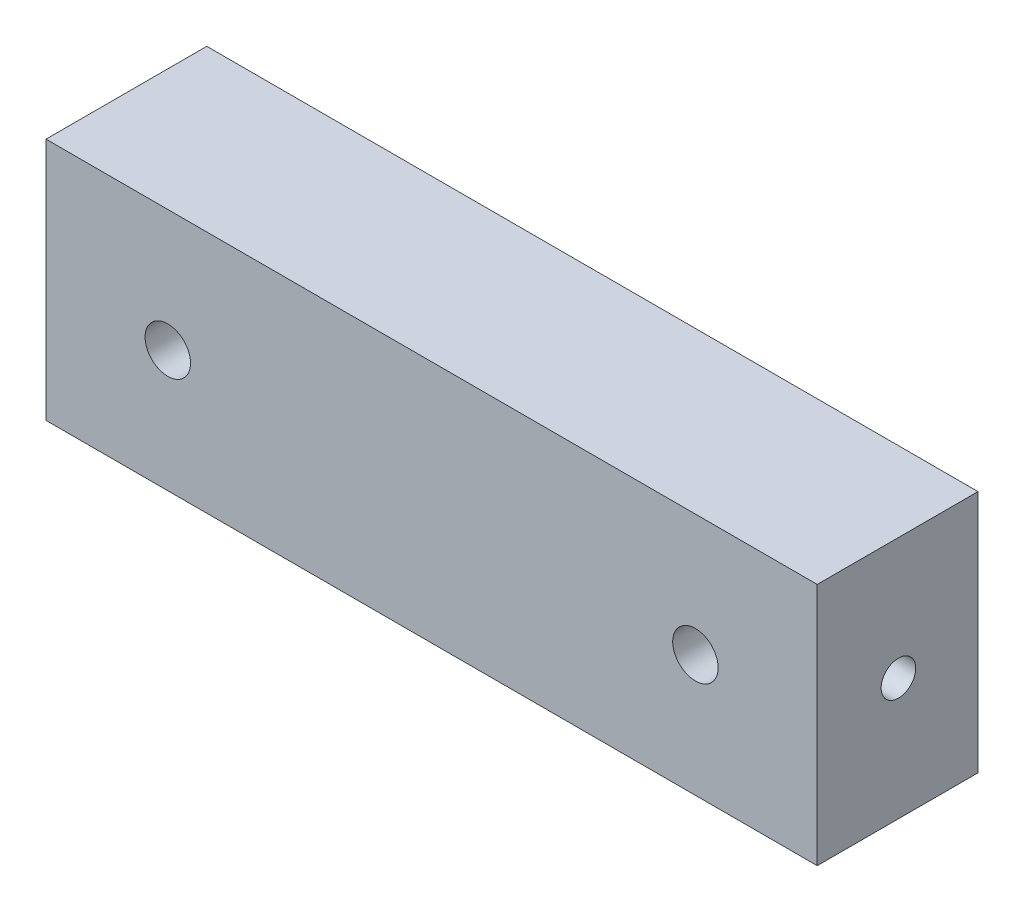
ISO-10303-21;
HEADER;
FILE_DESCRIPTION(('STEP AP214'),'2;1');
FILE_NAME('part.step','',(''),(''),'','','');
FILE_SCHEMA(('AUTOMOTIVE_DESIGN { 1 0 10303 214 1 1 1 1 }'));
ENDSEC;
DATA;
#1=APPLICATION_CONTEXT('core data for automotive mechanical design processes');
#2=APPLICATION_PROTOCOL_DEFINITION('international standard','automotive_design',2000,#1);
#3=PRODUCT_CONTEXT('',#1,'mechanical');
#4=PRODUCT('Part','Part','',(#3));
#5=PRODUCT_RELATED_PRODUCT_CATEGORY('part','',(#4));
#6=PRODUCT_DEFINITION_FORMATION('','',#4);
#7=PRODUCT_DEFINITION_CONTEXT('part definition',#1,'design');
#8=PRODUCT_DEFINITION('design','',#6,#7);
#9=PRODUCT_DEFINITION_SHAPE('','',#8);
#10=(LENGTH_UNIT() NAMED_UNIT(*) SI_UNIT(.MILLI.,.METRE.));
#11=(NAMED_UNIT(*) PLANE_ANGLE_UNIT() SI_UNIT($,.RADIAN.));
#12=(NAMED_UNIT(*) SI_UNIT($,.STERADIAN.) SOLID_ANGLE_UNIT());
#13=UNCERTAINTY_MEASURE_WITH_UNIT(LENGTH_MEASURE(1.E-05),#10,'distance_accuracy_value','');
#14=(GEOMETRIC_REPRESENTATION_CONTEXT(3) GLOBAL_UNCERTAINTY_ASSIGNED_CONTEXT((#13)) GLOBAL_UNIT_ASSIGNED_CONTEXT((#10,
#11,#12)) REPRESENTATION_CONTEXT('',''));
#15=CARTESIAN_POINT('',(0.,0.,0.));
#16=DIRECTION('',(0.,0.,1.));
#17=DIRECTION('',(1.,0.,0.));
#18=AXIS2_PLACEMENT_3D('',#15,#16,#17);
#19=CARTESIAN_POINT('',(0.,0.,12.573));
#20=DIRECTION('',(1.,0.,0.));
#21=DIRECTION('',(0.,0.,-1.));
#22=AXIS2_PLACEMENT_3D('',#19,#20,#21);
#23=PLANE('',#22);
#24=CARTESIAN_POINT('',(0.,9.525,6.223));
#25=DIRECTION('',(-1.,0.,0.));
#26=DIRECTION('',(0.,0.,1.));
#27=AXIS2_PLACEMENT_3D('',#24,#25,#26);
#28=CIRCLE('',#27,1.35255);
#29=CARTESIAN_POINT('',(0.,9.525,7.57555));
#30=VERTEX_POINT('',#29);
#31=EDGE_CURVE('E123',#30,#30,#28,.T.);
#32=ORIENTED_EDGE('',*,*,#31,.F.);
#33=EDGE_LOOP('',(#32));
#34=FACE_BOUND('',#33,.T.);
#35=DIRECTION('',(0.,-1.,0.));
#36=VECTOR('',#35,1.);
#37=CARTESIAN_POINT('',(0.,0.,0.));
#38=LINE('',#37,#36);
#39=CARTESIAN_POINT('',(0.,19.05,0.));
#40=VERTEX_POINT('',#39);
#41=CARTESIAN_POINT('',(0.,0.,0.));
#42=VERTEX_POINT('',#41);
#43=EDGE_CURVE('E108',#40,#42,#38,.T.);
#44=ORIENTED_EDGE('',*,*,#43,.T.);
#45=DIRECTION('',(0.,0.,-1.));
#46=VECTOR('',#45,1.);
#47=CARTESIAN_POINT('',(0.,0.,12.573));
#48=LINE('',#47,#46);
#49=CARTESIAN_POINT('',(0.,0.,12.573));
#50=VERTEX_POINT('',#49);
#51=EDGE_CURVE('E11',#50,#42,#48,.T.);
#52=ORIENTED_EDGE('',*,*,#51,.F.);
#53=DIRECTION('',(0.,-1.,0.));
#54=VECTOR('',#53,1.);
#55=CARTESIAN_POINT('',(0.,0.,12.573));
#56=LINE('',#55,#54);
#57=CARTESIAN_POINT('',(0.,19.05,12.573));
#58=VERTEX_POINT('',#57);
#59=EDGE_CURVE('E95',#58,#50,#56,.T.);
#60=ORIENTED_EDGE('',*,*,#59,.F.);
#61=DIRECTION('',(0.,0.,-1.));
#62=VECTOR('',#61,1.);
#63=CARTESIAN_POINT('',(0.,19.05,12.573));
#64=LINE('',#63,#62);
#65=EDGE_CURVE('E104',#58,#40,#64,.T.);
#66=ORIENTED_EDGE('',*,*,#65,.T.);
#67=EDGE_LOOP('',(#44,#52,#60,#66));
#68=FACE_BOUND('',#67,.T.);
#69=ADVANCED_FACE('F38',(#34,#68),#23,.F.);
#70=CARTESIAN_POINT('',(0.,0.,12.573));
#71=DIRECTION('',(0.,1.,0.));
#72=DIRECTION('',(0.,0.,1.));
#73=AXIS2_PLACEMENT_3D('',#70,#71,#72);
#74=PLANE('',#73);
#75=DIRECTION('',(1.,0.,0.));
#76=VECTOR('',#75,1.);
#77=CARTESIAN_POINT('',(0.,0.,0.));
#78=LINE('',#77,#76);
#79=CARTESIAN_POINT('',(60.3123,0.,0.));
#80=VERTEX_POINT('',#79);
#81=EDGE_CURVE('E99',#42,#80,#78,.T.);
#82=ORIENTED_EDGE('',*,*,#81,.T.);
#83=DIRECTION('',(0.,0.,-1.));
#84=VECTOR('',#83,1.);
#85=CARTESIAN_POINT('',(60.3123,0.,12.573));
#86=LINE('',#85,#84);
#87=CARTESIAN_POINT('',(60.3123,0.,12.573));
#88=VERTEX_POINT('',#87);
#89=EDGE_CURVE('E51',#88,#80,#86,.T.);
#90=ORIENTED_EDGE('',*,*,#89,.F.);
#91=DIRECTION('',(1.,0.,0.));
#92=VECTOR('',#91,1.);
#93=CARTESIAN_POINT('',(0.,0.,12.573));
#94=LINE('',#93,#92);
#95=EDGE_CURVE('E90',#50,#88,#94,.T.);
#96=ORIENTED_EDGE('',*,*,#95,.F.);
#97=ORIENTED_EDGE('',*,*,#51,.T.);
#98=EDGE_LOOP('',(#82,#90,#96,#97));
#99=FACE_BOUND('',#98,.T.);
#100=ADVANCED_FACE('F98',(#99),#74,.F.);
#101=CARTESIAN_POINT('',(60.3123,0.,12.573));
#102=DIRECTION('',(-1.,0.,0.));
#103=DIRECTION('',(0.,0.,1.));
#104=AXIS2_PLACEMENT_3D('',#101,#102,#103);
#105=PLANE('',#104);
#106=CARTESIAN_POINT('',(60.3123,9.525,6.223));
#107=DIRECTION('',(1.,0.,0.));
#108=DIRECTION('',(0.,0.,-1.));
#109=AXIS2_PLACEMENT_3D('',#106,#107,#108);
#110=CIRCLE('',#109,1.35254999999999);
#111=CARTESIAN_POINT('',(60.3123,9.525,4.87045000000001));
#112=VERTEX_POINT('',#111);
#113=EDGE_CURVE('E173',#112,#112,#110,.T.);
#114=ORIENTED_EDGE('',*,*,#113,.F.);
#115=EDGE_LOOP('',(#114));
#116=FACE_BOUND('',#115,.T.);
#117=DIRECTION('',(0.,1.,0.));
#118=VECTOR('',#117,1.);
#119=CARTESIAN_POINT('',(60.3123,0.,0.));
#120=LINE('',#119,#118);
#121=CARTESIAN_POINT('',(60.3123,19.05,0.));
#122=VERTEX_POINT('',#121);
#123=EDGE_CURVE('E77',#80,#122,#120,.T.);
#124=ORIENTED_EDGE('',*,*,#123,.T.);
#125=DIRECTION('',(0.,0.,-1.));
#126=VECTOR('',#125,1.);
#127=CARTESIAN_POINT('',(60.3123,19.05,12.573));
#128=LINE('',#127,#126);
#129=CARTESIAN_POINT('',(60.3123,19.05,12.573));
#130=VERTEX_POINT('',#129);
#131=EDGE_CURVE('E100',#130,#122,#128,.T.);
#132=ORIENTED_EDGE('',*,*,#131,.F.);
#133=DIRECTION('',(0.,1.,0.));
#134=VECTOR('',#133,1.);
#135=CARTESIAN_POINT('',(60.3123,0.,12.573));
#136=LINE('',#135,#134);
#137=EDGE_CURVE('E93',#88,#130,#136,.T.);
#138=ORIENTED_EDGE('',*,*,#137,.F.);
#139=ORIENTED_EDGE('',*,*,#89,.T.);
#140=EDGE_LOOP('',(#124,#132,#138,#139));
#141=FACE_BOUND('',#140,.T.);
#142=ADVANCED_FACE('F102',(#116,#141),#105,.F.);
#143=CARTESIAN_POINT('',(0.,19.05,12.573));
#144=DIRECTION('',(0.,-1.,0.));
#145=DIRECTION('',(0.,0.,-1.));
#146=AXIS2_PLACEMENT_3D('',#143,#144,#145);
#147=PLANE('',#146);
#148=DIRECTION('',(-1.,0.,0.));
#149=VECTOR('',#148,1.);
#150=CARTESIAN_POINT('',(0.,19.05,0.));
#151=LINE('',#150,#149);
#152=EDGE_CURVE('E83',#122,#40,#151,.T.);
#153=ORIENTED_EDGE('',*,*,#152,.T.);
#154=ORIENTED_EDGE('',*,*,#65,.F.);
#155=DIRECTION('',(-1.,0.,0.));
#156=VECTOR('',#155,1.);
#157=CARTESIAN_POINT('',(0.,19.05,12.573));
#158=LINE('',#157,#156);
#159=EDGE_CURVE('E60',#130,#58,#158,.T.);
#160=ORIENTED_EDGE('',*,*,#159,.F.);
#161=ORIENTED_EDGE('',*,*,#131,.T.);
#162=EDGE_LOOP('',(#153,#154,#160,#161));
#163=FACE_BOUND('',#162,.T.);
#164=ADVANCED_FACE('F160',(#163),#147,.F.);
#165=CARTESIAN_POINT('',(0.,19.05,12.573));
#166=DIRECTION('',(0.,0.,-1.));
#167=DIRECTION('',(-1.,0.,0.));
#168=AXIS2_PLACEMENT_3D('',#165,#166,#167);
#169=PLANE('',#168);
#170=CARTESIAN_POINT('',(50.7873,9.525,12.573));
#171=DIRECTION('',(0.,0.,1.));
#172=DIRECTION('',(1.,0.,0.));
#173=AXIS2_PLACEMENT_3D('',#170,#171,#172);
#174=CIRCLE('',#173,1.778);
#175=CARTESIAN_POINT('',(52.5653,9.525,12.573));
#176=VERTEX_POINT('',#175);
#177=EDGE_CURVE('E122',#176,#176,#174,.T.);
#178=ORIENTED_EDGE('',*,*,#177,.F.);
#179=EDGE_LOOP('',(#178));
#180=FACE_BOUND('',#179,.T.);
#181=CARTESIAN_POINT('',(9.525,9.525,12.573));
#182=DIRECTION('',(0.,0.,1.));
#183=DIRECTION('',(1.,0.,0.));
#184=AXIS2_PLACEMENT_3D('',#181,#182,#183);
#185=CIRCLE('',#184,1.778);
#186=CARTESIAN_POINT('',(11.303,9.525,12.573));
#187=VERTEX_POINT('',#186);
#188=EDGE_CURVE('E180',#187,#187,#185,.T.);
#189=ORIENTED_EDGE('',*,*,#188,.F.);
#190=EDGE_LOOP('',(#189));
#191=FACE_BOUND('',#190,.T.);
#192=ORIENTED_EDGE('',*,*,#59,.T.);
#193=ORIENTED_EDGE('',*,*,#95,.T.);
#194=ORIENTED_EDGE('',*,*,#137,.T.);
#195=ORIENTED_EDGE('',*,*,#159,.T.);
#196=EDGE_LOOP('',(#192,#193,#194,#195));
#197=FACE_BOUND('',#196,.T.);
#198=ADVANCED_FACE('F91',(#180,#191,#197),#169,.F.);
#199=CARTESIAN_POINT('',(0.,19.05,0.));
#200=DIRECTION('',(0.,0.,-1.));
#201=DIRECTION('',(-1.,0.,0.));
#202=AXIS2_PLACEMENT_3D('',#199,#200,#201);
#203=PLANE('',#202);
#204=CARTESIAN_POINT('',(50.7873,9.525,0.));
#205=DIRECTION('',(0.,0.,1.));
#206=DIRECTION('',(1.,0.,0.));
#207=AXIS2_PLACEMENT_3D('',#204,#205,#206);
#208=CIRCLE('',#207,1.778);
#209=CARTESIAN_POINT('',(52.5653,9.525,0.));
#210=VERTEX_POINT('',#209);
#211=EDGE_CURVE('E178',#210,#210,#208,.T.);
#212=ORIENTED_EDGE('',*,*,#211,.T.);
#213=EDGE_LOOP('',(#212));
#214=FACE_BOUND('',#213,.T.);
#215=CARTESIAN_POINT('',(9.525,9.525,0.));
#216=DIRECTION('',(0.,0.,1.));
#217=DIRECTION('',(1.,0.,0.));
#218=AXIS2_PLACEMENT_3D('',#215,#216,#217);
#219=CIRCLE('',#218,1.778);
#220=CARTESIAN_POINT('',(11.303,9.525,0.));
#221=VERTEX_POINT('',#220);
#222=EDGE_CURVE('E111',#221,#221,#219,.T.);
#223=ORIENTED_EDGE('',*,*,#222,.T.);
#224=EDGE_LOOP('',(#223));
#225=FACE_BOUND('',#224,.T.);
#226=ORIENTED_EDGE('',*,*,#43,.F.);
#227=ORIENTED_EDGE('',*,*,#152,.F.);
#228=ORIENTED_EDGE('',*,*,#123,.F.);
#229=ORIENTED_EDGE('',*,*,#81,.F.);
#230=EDGE_LOOP('',(#226,#227,#228,#229));
#231=FACE_BOUND('',#230,.T.);
#232=ADVANCED_FACE('F140',(#214,#225,#231),#203,.T.);
#233=CARTESIAN_POINT('',(9.525,9.525,0.));
#234=DIRECTION('',(0.,0.,1.));
#235=DIRECTION('',(1.,0.,0.));
#236=AXIS2_PLACEMENT_3D('',#233,#234,#235);
#237=CYLINDRICAL_SURFACE('',#236,1.778);
#238=CARTESIAN_POINT('',(7.747,9.525,7.57555));
#239=CARTESIAN_POINT('',(7.747005120892,9.59081623274751,7.5755446833929));
#240=CARTESIAN_POINT('',(7.75069180704347,9.65671589831385,7.57070816369258));
#241=CARTESIAN_POINT('',(7.76510620060708,9.78641557434088,7.55167255000671));
#242=CARTESIAN_POINT('',(7.77584802079086,9.85021110659428,7.53745468974687));
#243=CARTESIAN_POINT('',(7.80334387417839,9.97349892797805,7.50063692123175));
#244=CARTESIAN_POINT('',(7.82006206623453,10.0330143827258,7.47808695525382));
#245=CARTESIAN_POINT('',(7.85826484963585,10.1470106667715,7.42567816693626));
#246=CARTESIAN_POINT('',(7.87974870729648,10.201492269215,7.39582046956467));
#247=CARTESIAN_POINT('',(7.92831130362231,10.3096678425812,7.32671424106221));
#248=CARTESIAN_POINT('',(7.95572493229286,10.3628147456522,7.28684968849072));
#249=CARTESIAN_POINT('',(8.01291159967027,10.4621036174162,7.20052995103554));
#250=CARTESIAN_POINT('',(8.04268811527327,10.5082349608205,7.15406497142815));
#251=CARTESIAN_POINT('',(8.10900496126607,10.6021213130315,7.04484339777918));
#252=CARTESIAN_POINT('',(8.14565877823805,10.6482022124998,6.98071120837047));
#253=CARTESIAN_POINT('',(8.21572800092272,10.7291342448959,6.84408212220251));
#254=CARTESIAN_POINT('',(8.24914745104023,10.7639995325928,6.77159592695998));
#255=CARTESIAN_POINT('',(8.29695217354343,10.8110370464738,6.6452706947784));
#256=CARTESIAN_POINT('',(8.31390560203957,10.8268808765087,6.5937841477997));
#257=CARTESIAN_POINT('',(8.34202034458572,10.8524812927084,6.48784203144835));
#258=CARTESIAN_POINT('',(8.35319514399215,10.8622520622036,6.43339370535339));
#259=CARTESIAN_POINT('',(8.36799685777329,10.8750866771625,6.32208429271187));
#260=CARTESIAN_POINT('',(8.37154835864876,10.8780835268726,6.26520472618543));
#261=CARTESIAN_POINT('',(8.37011435505913,10.8768591661166,6.15162272078091));
#262=CARTESIAN_POINT('',(8.36512701100789,10.8726364002761,6.09492032270818));
#263=CARTESIAN_POINT('',(8.34868918991928,10.8582935993621,5.99021900090233));
#264=CARTESIAN_POINT('',(8.33806182563304,10.8489201360001,5.94197716646368));
#265=CARTESIAN_POINT('',(8.31234332562322,10.825404649053,5.8479089422327));
#266=CARTESIAN_POINT('',(8.29724761087562,10.8112577316923,5.80208508734661));
#267=CARTESIAN_POINT('',(8.25331963684761,10.7682054281516,5.68458420578281));
#268=CARTESIAN_POINT('',(8.22189336946962,10.7356577319655,5.61521356883487));
#269=CARTESIAN_POINT('',(8.15574124734123,10.6603174029444,5.48395060278225));
#270=CARTESIAN_POINT('',(8.12100728555834,10.6174991863835,5.42207753871658));
#271=CARTESIAN_POINT('',(8.05076058939236,10.5207821722936,5.30443085375405));
#272=CARTESIAN_POINT('',(8.01525468557508,10.4665966385413,5.24888774327815));
#273=CARTESIAN_POINT('',(7.94766167597324,10.3483539700435,5.14710849538209));
#274=CARTESIAN_POINT('',(7.91556832847098,10.2843154010676,5.10085522367229));
#275=CARTESIAN_POINT('',(7.86322171304458,10.1601460899398,5.02711172570514));
#276=CARTESIAN_POINT('',(7.8418778217344,10.1016068192729,4.99772503450837));
#277=CARTESIAN_POINT('',(7.80484318512855,9.97932872981405,4.94732756227599));
#278=CARTESIAN_POINT('',(7.78914908485993,9.91559302445471,4.92631180959688));
#279=CARTESIAN_POINT('',(7.76467961885104,9.78396250760968,4.89373241102885));
#280=CARTESIAN_POINT('',(7.755950831483,9.71604291483113,4.88223238001389));
#281=CARTESIAN_POINT('',(7.74648130533183,9.57869830881292,4.86976172685191));
#282=CARTESIAN_POINT('',(7.7457363096101,9.50927411761124,4.86878549343956));
#283=CARTESIAN_POINT('',(7.75193378618309,9.37904017289857,4.87694075169575));
#284=CARTESIAN_POINT('',(7.75804640859121,9.31811693992983,4.88498109119072));
#285=CARTESIAN_POINT('',(7.77614343520465,9.19876492480107,4.90897232845607));
#286=CARTESIAN_POINT('',(7.78812895137045,9.14033661730306,4.92492472428435));
#287=CARTESIAN_POINT('',(7.8174631416235,9.02581239210051,4.96444156098346));
#288=CARTESIAN_POINT('',(7.83494074597089,8.96981390233613,4.98818968347289));
#289=CARTESIAN_POINT('',(7.87399333905008,8.86264162072927,5.04220450053682));
#290=CARTESIAN_POINT('',(7.89556895002123,8.81146856334621,5.07247218513217));
#291=CARTESIAN_POINT('',(7.94540316390411,8.70642406420291,5.14410936557713));
#292=CARTESIAN_POINT('',(7.97417748397433,8.65348629076092,5.186485466556));
#293=CARTESIAN_POINT('',(8.0337895553744,8.55500033792529,5.27800133817605));
#294=CARTESIAN_POINT('',(8.06463134908374,8.50946726895183,5.32715457028009));
#295=CARTESIAN_POINT('',(8.13246661639644,8.41775406874433,5.44207462859235));
#296=CARTESIAN_POINT('',(8.16945775757638,8.37326299709856,5.50919853784452));
#297=CARTESIAN_POINT('',(8.23893597028817,8.29617984848311,5.65207824368));
#298=CARTESIAN_POINT('',(8.2714332405626,8.2635605445613,5.72781375948899));
#299=CARTESIAN_POINT('',(8.31512117799614,8.22191953572198,5.85688171085918));
#300=CARTESIAN_POINT('',(8.3297044855007,8.20864515291234,5.90767706166241));
#301=CARTESIAN_POINT('',(8.35283602039945,8.18800384716894,6.01173530998742));
#302=CARTESIAN_POINT('',(8.36139868779459,8.18062278379309,6.06499197471875));
#303=CARTESIAN_POINT('',(8.37110439257758,8.17227801069038,6.17310914680572));
#304=CARTESIAN_POINT('',(8.37219332350749,8.17136109717897,6.22797846771401));
#305=CARTESIAN_POINT('',(8.36658701652079,8.17615862059877,6.33704399621304));
#306=CARTESIAN_POINT('',(8.35988424721523,8.18187947352661,6.3912395012873));
#307=CARTESIAN_POINT('',(8.338341404683,8.20085679968915,6.50569713837867));
#308=CARTESIAN_POINT('',(8.32238337384578,8.21516069686164,6.56556561105243));
#309=CARTESIAN_POINT('',(8.28452072646679,8.25096267970898,6.68115137620063));
#310=CARTESIAN_POINT('',(8.26260068416956,8.27247946162342,6.73685741570176));
#311=CARTESIAN_POINT('',(8.20614841220181,8.33161511601366,6.86484725921215));
#312=CARTESIAN_POINT('',(8.17004511646936,8.37223886551396,6.93504241226056));
#313=CARTESIAN_POINT('',(8.09644023946366,8.46480332493383,7.06671584239478));
#314=CARTESIAN_POINT('',(8.05893708186944,8.51675713254151,7.12818389392398));
#315=CARTESIAN_POINT('',(7.98571443561246,8.63244888984702,7.24253677235028));
#316=CARTESIAN_POINT('',(7.95003060458601,8.69635353993682,7.29527735767779));
#317=CARTESIAN_POINT('',(7.88464941998115,8.83481348688169,7.38918474362665));
#318=CARTESIAN_POINT('',(7.85493842879659,8.90934384114051,7.43037799681311));
#319=CARTESIAN_POINT('',(7.8118819338652,9.04532145466365,7.48915812347842));
#320=CARTESIAN_POINT('',(7.79628329950264,9.10460392776768,7.51012493621694));
#321=CARTESIAN_POINT('',(7.77111338349718,9.22664002123375,7.54373929680195));
#322=CARTESIAN_POINT('',(7.7615271932244,9.28938463263237,7.55640742580359));
#323=CARTESIAN_POINT('',(7.7525759520528,9.38140466305832,7.56821326272973));
#324=CARTESIAN_POINT('',(7.75049009113595,9.41000665892609,7.57095934530937));
#325=CARTESIAN_POINT('',(7.74770083716958,9.46740041401884,7.57462908475432));
#326=CARTESIAN_POINT('',(7.74699775858402,9.49619221491479,7.57555232708054));
#327=CARTESIAN_POINT('',(7.747,9.525,7.57555));
#328=B_SPLINE_CURVE_WITH_KNOTS('',3,(#238,#239,#240,#241,#242,#243,#244,#245,#246,#247,#248,
#249,#250,#251,#252,#253,#254,#255,#256,#257,#258,#259,#260,#261,#262,#263,#264,#265,#266,#267,
#268,#269,#270,#271,#272,#273,#274,#275,#276,#277,#278,#279,#280,#281,#282,#283,#284,#285,#286,
#287,#288,#289,#290,#291,#292,#293,#294,#295,#296,#297,#298,#299,#300,#301,#302,#303,#304,#305,
#306,#307,#308,#309,#310,#311,#312,#313,#314,#315,#316,#317,#318,#319,#320,#321,#322,#323,#324,
#325,#326,#327),.UNSPECIFIED.,.T.,.F.,(4,2,2,2,2,2,2,2,2,2,2,2,2,2,2,2,2,2,2,2,2,2,2,2,2,2,2,2,
2,2,2,2,2,2,2,2,2,2,2,2,2,2,2,2,4),(0.,0.197324853760894,0.39504563437113,0.591600018001237,
0.78812416263308,1.00297190457147,1.21814186734088,1.4782627572921,1.73805405937842,
1.90692296780565,2.07539599465778,2.24552810398773,2.41569687074086,2.56598590406469,
2.71642948519279,2.96353615933085,3.21126488478738,3.46621839153259,3.72069725115884,
3.92654991199555,4.13228013046612,4.33937483963228,4.54635912089801,4.73076101359689,
4.91519783403363,5.10433636955439,5.2935036467709,5.51369238067729,5.73432495268798,
5.99904821875222,6.26316047928862,6.42605919862902,6.5885658739052,6.75224779423849,
6.91608805972398,7.10580396949174,7.29601548671726,7.56097992269594,7.82625230004865,
8.09554602768511,8.36421772123898,8.55780337349536,8.75090708745218,8.83725660112776,
8.92362574961613),.UNSPECIFIED.);
#329=CARTESIAN_POINT('',(7.747,9.525,7.57555));
#330=VERTEX_POINT('',#329);
#331=EDGE_CURVE('E116',#330,#330,#328,.T.);
#332=ORIENTED_EDGE('',*,*,#331,.T.);
#333=EDGE_LOOP('',(#332));
#334=FACE_BOUND('',#333,.T.);
#335=ORIENTED_EDGE('',*,*,#222,.F.);
#336=EDGE_LOOP('',(#335));
#337=FACE_BOUND('',#336,.T.);
#338=ORIENTED_EDGE('',*,*,#188,.T.);
#339=EDGE_LOOP('',(#338));
#340=FACE_BOUND('',#339,.T.);
#341=ADVANCED_FACE('F124',(#334,#337,#340),#237,.F.);
#342=CARTESIAN_POINT('',(50.7873,9.525,0.));
#343=DIRECTION('',(0.,0.,1.));
#344=DIRECTION('',(1.,0.,0.));
#345=AXIS2_PLACEMENT_3D('',#342,#343,#344);
#346=CYLINDRICAL_SURFACE('',#345,1.778);
#347=CARTESIAN_POINT('',(52.5653,9.525,4.87045000000001));
#348=CARTESIAN_POINT('',(52.565294879108,9.59081623274751,4.87045531660711));
#349=CARTESIAN_POINT('',(52.5616081929565,9.65671589831385,4.87529183630742));
#350=CARTESIAN_POINT('',(52.5471937993929,9.78641557434088,4.8943274499933));
#351=CARTESIAN_POINT('',(52.5364519792091,9.85021110659428,4.90854531025314));
#352=CARTESIAN_POINT('',(52.5089561258216,9.97349892797804,4.94536307876826));
#353=CARTESIAN_POINT('',(52.4922379337655,10.0330143827258,4.96791304474618));
#354=CARTESIAN_POINT('',(52.4540351503641,10.1470106667715,5.02032183306375));
#355=CARTESIAN_POINT('',(52.4325512927035,10.201492269215,5.05017953043534));
#356=CARTESIAN_POINT('',(52.3839886963777,10.3096678425812,5.1192857589378));
#357=CARTESIAN_POINT('',(52.3565750677071,10.3628147456522,5.15915031150929));
#358=CARTESIAN_POINT('',(52.2993884003297,10.4621036174162,5.24547004896446));
#359=CARTESIAN_POINT('',(52.2696118847267,10.5082349608205,5.29193502857186));
#360=CARTESIAN_POINT('',(52.2032950387339,10.6021213130315,5.40115660222083));
#361=CARTESIAN_POINT('',(52.1666412217619,10.6482022124998,5.46528879162954));
#362=CARTESIAN_POINT('',(52.0965719990773,10.7291342448959,5.6019178777975));
#363=CARTESIAN_POINT('',(52.0631525489598,10.7639995325928,5.67440407304003));
#364=CARTESIAN_POINT('',(52.0153478264566,10.8110370464738,5.8007293052216));
#365=CARTESIAN_POINT('',(51.9983943979604,10.8268808765087,5.85221585220031));
#366=CARTESIAN_POINT('',(51.9702796554143,10.8524812927084,5.95815796855166));
#367=CARTESIAN_POINT('',(51.9591048560079,10.8622520622036,6.01260629464662));
#368=CARTESIAN_POINT('',(51.9443031422267,10.8750866771625,6.12391570728814));
#369=CARTESIAN_POINT('',(51.9407516413512,10.8780835268726,6.18079527381458));
#370=CARTESIAN_POINT('',(51.9421856449409,10.8768591661166,6.29437727921909));
#371=CARTESIAN_POINT('',(51.9471729889921,10.8726364002761,6.35107967729182));
#372=CARTESIAN_POINT('',(51.9636108100807,10.8582935993621,6.45578099909767));
#373=CARTESIAN_POINT('',(51.974238174367,10.8489201360001,6.50402283353632));
#374=CARTESIAN_POINT('',(51.9999566743768,10.825404649053,6.5980910577673));
#375=CARTESIAN_POINT('',(52.0150523891244,10.8112577316922,6.64391491265339));
#376=CARTESIAN_POINT('',(52.0589803631524,10.7682054281516,6.76141579421719));
#377=CARTESIAN_POINT('',(52.0904066305304,10.7356577319654,6.83078643116513));
#378=CARTESIAN_POINT('',(52.1565587526588,10.6603174029444,6.96204939721775));
#379=CARTESIAN_POINT('',(52.1912927144417,10.6174991863835,7.02392246128342));
#380=CARTESIAN_POINT('',(52.2615394106076,10.5207821722936,7.14156914624595));
#381=CARTESIAN_POINT('',(52.2970453144249,10.4665966385413,7.19711225672185));
#382=CARTESIAN_POINT('',(52.3646383240268,10.3483539700435,7.29889150461791));
#383=CARTESIAN_POINT('',(52.396731671529,10.2843154010675,7.34514477632771));
#384=CARTESIAN_POINT('',(52.4490782869554,10.1601460899398,7.41888827429486));
#385=CARTESIAN_POINT('',(52.4704221782656,10.1016068192728,7.44827496549163));
#386=CARTESIAN_POINT('',(52.5074568148714,9.97932872981403,7.498672437724));
#387=CARTESIAN_POINT('',(52.5231509151401,9.91559302445469,7.51968819040311));
#388=CARTESIAN_POINT('',(52.547620381149,9.78396250760967,7.55226758897114));
#389=CARTESIAN_POINT('',(52.556349168517,9.71604291483112,7.5637676199861));
#390=CARTESIAN_POINT('',(52.5658186946682,9.57869830881291,7.57623827314808));
#391=CARTESIAN_POINT('',(52.5665636903899,9.50927411761123,7.57721450656043));
#392=CARTESIAN_POINT('',(52.5603662138169,9.37904017289856,7.56905924830424));
#393=CARTESIAN_POINT('',(52.5542535914088,9.31811693992982,7.56101890880927));
#394=CARTESIAN_POINT('',(52.5361565647953,9.19876492480106,7.53702767154392));
#395=CARTESIAN_POINT('',(52.5241710486295,9.14033661730305,7.52107527571564));
#396=CARTESIAN_POINT('',(52.4948368583765,9.02581239210051,7.48155843901652));
#397=CARTESIAN_POINT('',(52.4773592540291,8.96981390233613,7.45781031652709));
#398=CARTESIAN_POINT('',(52.4383066609499,8.86264162072927,7.40379549946316));
#399=CARTESIAN_POINT('',(52.4167310499788,8.81146856334621,7.37352781486782));
#400=CARTESIAN_POINT('',(52.3668968360959,8.7064240642029,7.30189063442285));
#401=CARTESIAN_POINT('',(52.3381225160257,8.65348629076092,7.25951453344398));
#402=CARTESIAN_POINT('',(52.2785104446256,8.55500033792528,7.16799866182393));
#403=CARTESIAN_POINT('',(52.2476686509163,8.50946726895182,7.11884542971989));
#404=CARTESIAN_POINT('',(52.1798333836036,8.41775406874433,7.00392537140763));
#405=CARTESIAN_POINT('',(52.1428422424236,8.37326299709856,6.93680146215546));
#406=CARTESIAN_POINT('',(52.0733640297118,8.29617984848312,6.79392175631998));
#407=CARTESIAN_POINT('',(52.0408667594374,8.26356054456131,6.71818624051099));
#408=CARTESIAN_POINT('',(51.9971788220039,8.22191953572198,6.5891182891408));
#409=CARTESIAN_POINT('',(51.9825955144993,8.20864515291235,6.53832293833757));
#410=CARTESIAN_POINT('',(51.9594639796005,8.18800384716895,6.43426469001256));
#411=CARTESIAN_POINT('',(51.9509013122054,8.1806227837931,6.38100802528123));
#412=CARTESIAN_POINT('',(51.9411956074224,8.17227801069039,6.27289085319426));
#413=CARTESIAN_POINT('',(51.9401066764925,8.17136109717898,6.21802153228597));
#414=CARTESIAN_POINT('',(51.9457129834792,8.17615862059878,6.10895600378695));
#415=CARTESIAN_POINT('',(51.9524157527848,8.18187947352662,6.05476049871268));
#416=CARTESIAN_POINT('',(51.973958595317,8.20085679968916,5.94030286162132));
#417=CARTESIAN_POINT('',(51.9899166261542,8.21516069686165,5.88043438894756));
#418=CARTESIAN_POINT('',(52.0277792735332,8.250962679709,5.76484862379935));
#419=CARTESIAN_POINT('',(52.0496993158305,8.27247946162343,5.70914258429822));
#420=CARTESIAN_POINT('',(52.1061515877982,8.33161511601368,5.58115274078784));
#421=CARTESIAN_POINT('',(52.1422548835306,8.37223886551398,5.51095758773943));
#422=CARTESIAN_POINT('',(52.2158597605363,8.46480332493385,5.37928415760521));
#423=CARTESIAN_POINT('',(52.2533629181306,8.51675713254153,5.31781610607601));
#424=CARTESIAN_POINT('',(52.3265855643875,8.63244888984705,5.20346322764971));
#425=CARTESIAN_POINT('',(52.362269395414,8.69635353993685,5.1507226423222));
#426=CARTESIAN_POINT('',(52.4276505800189,8.83481348688172,5.05681525637335));
#427=CARTESIAN_POINT('',(52.4573615712034,8.90934384114054,5.01562200318689));
#428=CARTESIAN_POINT('',(52.5004180661348,9.04532145466368,4.95684187652158));
#429=CARTESIAN_POINT('',(52.5160167004974,9.10460392776772,4.93587506378306));
#430=CARTESIAN_POINT('',(52.5411866165028,9.22664002123378,4.90226070319805));
#431=CARTESIAN_POINT('',(52.5507728067756,9.2893846326324,4.88959257419642));
#432=CARTESIAN_POINT('',(52.5597240479472,9.38140466305834,4.87778673727028));
#433=CARTESIAN_POINT('',(52.561809908864,9.41000665892611,4.87504065469063));
#434=CARTESIAN_POINT('',(52.5645991628304,9.46740041401885,4.87137091524569));
#435=CARTESIAN_POINT('',(52.565302241416,9.49619221491479,4.87044767291947));
#436=CARTESIAN_POINT('',(52.5653,9.525,4.87045000000001));
#437=B_SPLINE_CURVE_WITH_KNOTS('',3,(#347,#348,#349,#350,#351,#352,#353,#354,#355,#356,#357,
#358,#359,#360,#361,#362,#363,#364,#365,#366,#367,#368,#369,#370,#371,#372,#373,#374,#375,#376,
#377,#378,#379,#380,#381,#382,#383,#384,#385,#386,#387,#388,#389,#390,#391,#392,#393,#394,#395,
#396,#397,#398,#399,#400,#401,#402,#403,#404,#405,#406,#407,#408,#409,#410,#411,#412,#413,#414,
#415,#416,#417,#418,#419,#420,#421,#422,#423,#424,#425,#426,#427,#428,#429,#430,#431,#432,#433,
#434,#435,#436),.UNSPECIFIED.,.T.,.F.,(4,2,2,2,2,2,2,2,2,2,2,2,2,2,2,2,2,2,2,2,2,2,2,2,2,2,2,2,
2,2,2,2,2,2,2,2,2,2,2,2,2,2,2,2,4),(0.,0.197324853760894,0.395045634371128,0.591600018001237,
0.788124162633077,1.00297190457146,1.21814186734087,1.47826275729209,1.73805405937841,
1.90692296780565,2.07539599465778,2.24552810398772,2.41569687074085,2.56598590406468,
2.71642948519278,2.96353615933084,3.21126488478737,3.46621839153257,3.72069725115883,
3.92654991199554,4.1322801304661,4.33937483963225,4.54635912089798,4.73076101359687,
4.9151978340336,5.10433636955436,5.29350364677088,5.51369238067726,5.73432495268796,
5.9990482187522,6.26316047928859,6.42605919862899,6.58856587390517,6.75224779423845,
6.91608805972394,7.1058039694917,7.29601548671723,7.5609799226959,7.82625230004861,
8.09554602768507,8.36421772123895,8.55780337349533,8.75090708745214,8.8372566011277,
8.92362574961606),.UNSPECIFIED.);
#438=CARTESIAN_POINT('',(52.5653,9.525,4.87045000000001));
#439=VERTEX_POINT('',#438);
#440=EDGE_CURVE('E41',#439,#439,#437,.T.);
#441=ORIENTED_EDGE('',*,*,#440,.T.);
#442=EDGE_LOOP('',(#441));
#443=FACE_BOUND('',#442,.T.);
#444=ORIENTED_EDGE('',*,*,#211,.F.);
#445=EDGE_LOOP('',(#444));
#446=FACE_BOUND('',#445,.T.);
#447=ORIENTED_EDGE('',*,*,#177,.T.);
#448=EDGE_LOOP('',(#447));
#449=FACE_BOUND('',#448,.T.);
#450=ADVANCED_FACE('F131',(#443,#446,#449),#346,.F.);
#451=CARTESIAN_POINT('',(0.,9.525,6.223));
#452=DIRECTION('',(-1.,0.,0.));
#453=DIRECTION('',(0.,0.,1.));
#454=AXIS2_PLACEMENT_3D('',#451,#452,#453);
#455=CYLINDRICAL_SURFACE('',#454,1.35255);
#456=ORIENTED_EDGE('',*,*,#31,.T.);
#457=EDGE_LOOP('',(#456));
#458=FACE_BOUND('',#457,.T.);
#459=ORIENTED_EDGE('',*,*,#331,.F.);
#460=EDGE_LOOP('',(#459));
#461=FACE_BOUND('',#460,.T.);
#462=ADVANCED_FACE('F127',(#458,#461),#455,.F.);
#463=CARTESIAN_POINT('',(60.3123,9.525,6.223));
#464=DIRECTION('',(1.,0.,0.));
#465=DIRECTION('',(0.,0.,-1.));
#466=AXIS2_PLACEMENT_3D('',#463,#464,#465);
#467=CYLINDRICAL_SURFACE('',#466,1.35254999999999);
#468=ORIENTED_EDGE('',*,*,#113,.T.);
#469=EDGE_LOOP('',(#468));
#470=FACE_BOUND('',#469,.T.);
#471=ORIENTED_EDGE('',*,*,#440,.F.);
#472=EDGE_LOOP('',(#471));
#473=FACE_BOUND('',#472,.T.);
#474=ADVANCED_FACE('F130',(#470,#473),#467,.F.);
#475=CLOSED_SHELL('',(#69,#100,#142,#164,#198,#232,#341,#450,#462,#474));
#476=MANIFOLD_SOLID_BREP('B2',#475);
#477=ADVANCED_BREP_SHAPE_REPRESENTATION('',(#18,#476),#14);
#478=SHAPE_DEFINITION_REPRESENTATION(#9,#477);
ENDSEC;
END-ISO-10303-21;
